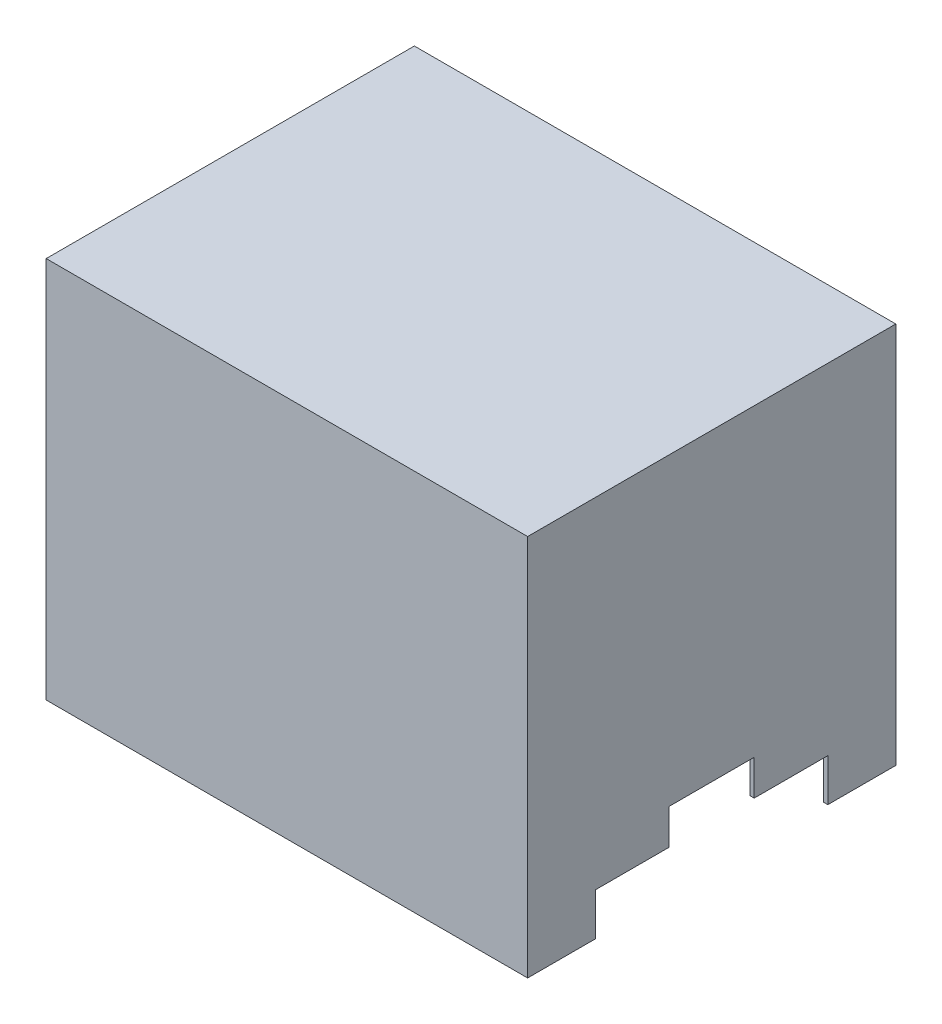
ISO-10303-21;
HEADER;
FILE_DESCRIPTION(('STEP AP214'),'2;1');
FILE_NAME('part.step','',(''),(''),'','','');
FILE_SCHEMA(('AUTOMOTIVE_DESIGN { 1 0 10303 214 1 1 1 1 }'));
ENDSEC;
DATA;
#1=APPLICATION_CONTEXT('core data for automotive mechanical design processes');
#2=APPLICATION_PROTOCOL_DEFINITION('international standard','automotive_design',2000,#1);
#3=PRODUCT_CONTEXT('',#1,'mechanical');
#4=PRODUCT('Part','Part','',(#3));
#5=PRODUCT_RELATED_PRODUCT_CATEGORY('part','',(#4));
#6=PRODUCT_DEFINITION_FORMATION('','',#4);
#7=PRODUCT_DEFINITION_CONTEXT('part definition',#1,'design');
#8=PRODUCT_DEFINITION('design','',#6,#7);
#9=PRODUCT_DEFINITION_SHAPE('','',#8);
#10=(LENGTH_UNIT() NAMED_UNIT(*) SI_UNIT(.MILLI.,.METRE.));
#11=(NAMED_UNIT(*) PLANE_ANGLE_UNIT() SI_UNIT($,.RADIAN.));
#12=(NAMED_UNIT(*) SI_UNIT($,.STERADIAN.) SOLID_ANGLE_UNIT());
#13=UNCERTAINTY_MEASURE_WITH_UNIT(LENGTH_MEASURE(1.E-05),#10,'distance_accuracy_value','');
#14=(GEOMETRIC_REPRESENTATION_CONTEXT(3) GLOBAL_UNCERTAINTY_ASSIGNED_CONTEXT((#13)) GLOBAL_UNIT_ASSIGNED_CONTEXT((#10,
#11,#12)) REPRESENTATION_CONTEXT('',''));
#15=CARTESIAN_POINT('',(0.,0.,0.));
#16=DIRECTION('',(0.,0.,1.));
#17=DIRECTION('',(1.,0.,0.));
#18=AXIS2_PLACEMENT_3D('',#15,#16,#17);
#19=CARTESIAN_POINT('',(0.,0.,0.));
#20=DIRECTION('',(0.,1.,0.));
#21=DIRECTION('',(0.,0.,1.));
#22=AXIS2_PLACEMENT_3D('',#19,#20,#21);
#23=PLANE('',#22);
#24=DIRECTION('',(0.,0.,1.));
#25=VECTOR('',#24,1.);
#26=CARTESIAN_POINT('',(-170.,0.,-130.));
#27=LINE('',#26,#25);
#28=CARTESIAN_POINT('',(-170.,0.,82.));
#29=VERTEX_POINT('',#28);
#30=CARTESIAN_POINT('',(-170.,0.,130.));
#31=VERTEX_POINT('',#30);
#32=EDGE_CURVE('E233',#29,#31,#27,.T.);
#33=ORIENTED_EDGE('',*,*,#32,.F.);
#34=DIRECTION('',(1.,0.,0.));
#35=VECTOR('',#34,1.);
#36=CARTESIAN_POINT('',(-170.,0.,82.));
#37=LINE('',#36,#35);
#38=CARTESIAN_POINT('',(-167.,0.,82.));
#39=VERTEX_POINT('',#38);
#40=EDGE_CURVE('E304',#29,#39,#37,.T.);
#41=ORIENTED_EDGE('',*,*,#40,.T.);
#42=DIRECTION('',(0.,0.,-1.));
#43=VECTOR('',#42,1.);
#44=CARTESIAN_POINT('',(-167.,0.,127.));
#45=LINE('',#44,#43);
#46=CARTESIAN_POINT('',(-167.,0.,127.));
#47=VERTEX_POINT('',#46);
#48=EDGE_CURVE('E383',#47,#39,#45,.T.);
#49=ORIENTED_EDGE('',*,*,#48,.F.);
#50=DIRECTION('',(-1.,0.,0.));
#51=VECTOR('',#50,1.);
#52=CARTESIAN_POINT('',(-167.,0.,127.));
#53=LINE('',#52,#51);
#54=CARTESIAN_POINT('',(167.,0.,127.));
#55=VERTEX_POINT('',#54);
#56=EDGE_CURVE('E379',#55,#47,#53,.T.);
#57=ORIENTED_EDGE('',*,*,#56,.F.);
#58=DIRECTION('',(0.,0.,1.));
#59=VECTOR('',#58,1.);
#60=CARTESIAN_POINT('',(167.,0.,127.));
#61=LINE('',#60,#59);
#62=CARTESIAN_POINT('',(167.,0.,82.));
#63=VERTEX_POINT('',#62);
#64=EDGE_CURVE('E356',#63,#55,#61,.T.);
#65=ORIENTED_EDGE('',*,*,#64,.F.);
#66=CARTESIAN_POINT('',(170.,0.,82.));
#67=VERTEX_POINT('',#66);
#68=EDGE_CURVE('E297',#63,#67,#37,.T.);
#69=ORIENTED_EDGE('',*,*,#68,.T.);
#70=DIRECTION('',(0.,0.,-1.));
#71=VECTOR('',#70,1.);
#72=CARTESIAN_POINT('',(170.,0.,-130.));
#73=LINE('',#72,#71);
#74=CARTESIAN_POINT('',(170.,0.,130.));
#75=VERTEX_POINT('',#74);
#76=EDGE_CURVE('E413',#75,#67,#73,.T.);
#77=ORIENTED_EDGE('',*,*,#76,.F.);
#78=DIRECTION('',(1.,0.,0.));
#79=VECTOR('',#78,1.);
#80=CARTESIAN_POINT('',(-170.,0.,130.));
#81=LINE('',#80,#79);
#82=EDGE_CURVE('E232',#31,#75,#81,.T.);
#83=ORIENTED_EDGE('',*,*,#82,.F.);
#84=EDGE_LOOP('',(#33,#41,#49,#57,#65,#69,#77,#83));
#85=FACE_BOUND('',#84,.T.);
#86=ADVANCED_FACE('F41',(#85),#23,.F.);
#87=CARTESIAN_POINT('',(170.,270.,-130.));
#88=DIRECTION('',(-1.,0.,0.));
#89=DIRECTION('',(0.,0.,1.));
#90=AXIS2_PLACEMENT_3D('',#87,#88,#89);
#91=PLANE('',#90);
#92=ORIENTED_EDGE('',*,*,#76,.T.);
#93=DIRECTION('',(0.,-1.,0.));
#94=VECTOR('',#93,1.);
#95=CARTESIAN_POINT('',(170.,0.,82.));
#96=LINE('',#95,#94);
#97=CARTESIAN_POINT('',(170.,30.,82.));
#98=VERTEX_POINT('',#97);
#99=EDGE_CURVE('E211',#98,#67,#96,.T.);
#100=ORIENTED_EDGE('',*,*,#99,.F.);
#101=DIRECTION('',(0.,0.,1.));
#102=VECTOR('',#101,1.);
#103=CARTESIAN_POINT('',(170.,30.,82.));
#104=LINE('',#103,#102);
#105=CARTESIAN_POINT('',(170.,30.,30.));
#106=VERTEX_POINT('',#105);
#107=EDGE_CURVE('E504',#106,#98,#104,.T.);
#108=ORIENTED_EDGE('',*,*,#107,.F.);
#109=DIRECTION('',(0.,-1.,0.));
#110=VECTOR('',#109,1.);
#111=CARTESIAN_POINT('',(170.,30.,30.));
#112=LINE('',#111,#110);
#113=CARTESIAN_POINT('',(170.,55.,30.));
#114=VERTEX_POINT('',#113);
#115=EDGE_CURVE('E455',#114,#106,#112,.T.);
#116=ORIENTED_EDGE('',*,*,#115,.F.);
#117=DIRECTION('',(0.,0.,1.));
#118=VECTOR('',#117,1.);
#119=CARTESIAN_POINT('',(170.,55.,30.));
#120=LINE('',#119,#118);
#121=CARTESIAN_POINT('',(170.,55.,-30.));
#122=VERTEX_POINT('',#121);
#123=EDGE_CURVE('E510',#122,#114,#120,.T.);
#124=ORIENTED_EDGE('',*,*,#123,.F.);
#125=DIRECTION('',(0.,1.,0.));
#126=VECTOR('',#125,1.);
#127=CARTESIAN_POINT('',(170.,55.,-30.));
#128=LINE('',#127,#126);
#129=CARTESIAN_POINT('',(170.,30.,-30.));
#130=VERTEX_POINT('',#129);
#131=EDGE_CURVE('E515',#130,#122,#128,.T.);
#132=ORIENTED_EDGE('',*,*,#131,.F.);
#133=DIRECTION('',(0.,0.,1.));
#134=VECTOR('',#133,1.);
#135=CARTESIAN_POINT('',(170.,30.,-30.));
#136=LINE('',#135,#134);
#137=CARTESIAN_POINT('',(170.,30.,-82.));
#138=VERTEX_POINT('',#137);
#139=EDGE_CURVE('E520',#138,#130,#136,.T.);
#140=ORIENTED_EDGE('',*,*,#139,.F.);
#141=DIRECTION('',(0.,1.,0.));
#142=VECTOR('',#141,1.);
#143=CARTESIAN_POINT('',(170.,30.,-82.));
#144=LINE('',#143,#142);
#145=CARTESIAN_POINT('',(170.,0.,-82.));
#146=VERTEX_POINT('',#145);
#147=EDGE_CURVE('E427',#146,#138,#144,.T.);
#148=ORIENTED_EDGE('',*,*,#147,.F.);
#149=CARTESIAN_POINT('',(170.,0.,-130.));
#150=VERTEX_POINT('',#149);
#151=EDGE_CURVE('E392',#146,#150,#73,.T.);
#152=ORIENTED_EDGE('',*,*,#151,.T.);
#153=DIRECTION('',(0.,-1.,0.));
#154=VECTOR('',#153,1.);
#155=CARTESIAN_POINT('',(170.,270.,-130.));
#156=LINE('',#155,#154);
#157=CARTESIAN_POINT('',(170.,270.,-130.));
#158=VERTEX_POINT('',#157);
#159=EDGE_CURVE('E255',#158,#150,#156,.T.);
#160=ORIENTED_EDGE('',*,*,#159,.F.);
#161=DIRECTION('',(0.,0.,-1.));
#162=VECTOR('',#161,1.);
#163=CARTESIAN_POINT('',(170.,270.,-130.));
#164=LINE('',#163,#162);
#165=CARTESIAN_POINT('',(170.,270.,130.));
#166=VERTEX_POINT('',#165);
#167=EDGE_CURVE('E238',#166,#158,#164,.T.);
#168=ORIENTED_EDGE('',*,*,#167,.F.);
#169=DIRECTION('',(0.,-1.,0.));
#170=VECTOR('',#169,1.);
#171=CARTESIAN_POINT('',(170.,270.,130.));
#172=LINE('',#171,#170);
#173=EDGE_CURVE('E244',#166,#75,#172,.T.);
#174=ORIENTED_EDGE('',*,*,#173,.T.);
#175=EDGE_LOOP('',(#92,#100,#108,#116,#124,#132,#140,#148,#152,#160,#168,#174));
#176=FACE_BOUND('',#175,.T.);
#177=ADVANCED_FACE('F43',(#176),#91,.F.);
#178=CARTESIAN_POINT('',(-170.,270.,-130.));
#179=DIRECTION('',(0.,0.,1.));
#180=DIRECTION('',(1.,0.,0.));
#181=AXIS2_PLACEMENT_3D('',#178,#179,#180);
#182=PLANE('',#181);
#183=DIRECTION('',(-1.,0.,0.));
#184=VECTOR('',#183,1.);
#185=CARTESIAN_POINT('',(-170.,0.,-130.));
#186=LINE('',#185,#184);
#187=CARTESIAN_POINT('',(-170.,0.,-130.));
#188=VERTEX_POINT('',#187);
#189=EDGE_CURVE('E240',#150,#188,#186,.T.);
#190=ORIENTED_EDGE('',*,*,#189,.T.);
#191=DIRECTION('',(0.,-1.,0.));
#192=VECTOR('',#191,1.);
#193=CARTESIAN_POINT('',(-170.,270.,-130.));
#194=LINE('',#193,#192);
#195=CARTESIAN_POINT('',(-170.,270.,-130.));
#196=VERTEX_POINT('',#195);
#197=EDGE_CURVE('E230',#196,#188,#194,.T.);
#198=ORIENTED_EDGE('',*,*,#197,.F.);
#199=DIRECTION('',(-1.,0.,0.));
#200=VECTOR('',#199,1.);
#201=CARTESIAN_POINT('',(-170.,270.,-130.));
#202=LINE('',#201,#200);
#203=EDGE_CURVE('E406',#158,#196,#202,.T.);
#204=ORIENTED_EDGE('',*,*,#203,.F.);
#205=ORIENTED_EDGE('',*,*,#159,.T.);
#206=EDGE_LOOP('',(#190,#198,#204,#205));
#207=FACE_BOUND('',#206,.T.);
#208=ADVANCED_FACE('F430',(#207),#182,.F.);
#209=CARTESIAN_POINT('',(-170.,270.,-130.));
#210=DIRECTION('',(1.,0.,0.));
#211=DIRECTION('',(0.,0.,-1.));
#212=AXIS2_PLACEMENT_3D('',#209,#210,#211);
#213=PLANE('',#212);
#214=DIRECTION('',(0.,0.,1.));
#215=VECTOR('',#214,1.);
#216=CARTESIAN_POINT('',(-170.,30.,82.));
#217=LINE('',#216,#215);
#218=CARTESIAN_POINT('',(-170.,30.,30.));
#219=VERTEX_POINT('',#218);
#220=CARTESIAN_POINT('',(-170.,30.,82.));
#221=VERTEX_POINT('',#220);
#222=EDGE_CURVE('E478',#219,#221,#217,.T.);
#223=ORIENTED_EDGE('',*,*,#222,.T.);
#224=DIRECTION('',(0.,-1.,0.));
#225=VECTOR('',#224,1.);
#226=CARTESIAN_POINT('',(-170.,0.,82.));
#227=LINE('',#226,#225);
#228=EDGE_CURVE('E295',#221,#29,#227,.T.);
#229=ORIENTED_EDGE('',*,*,#228,.T.);
#230=ORIENTED_EDGE('',*,*,#32,.T.);
#231=DIRECTION('',(0.,-1.,0.));
#232=VECTOR('',#231,1.);
#233=CARTESIAN_POINT('',(-170.,270.,130.));
#234=LINE('',#233,#232);
#235=CARTESIAN_POINT('',(-170.,270.,130.));
#236=VERTEX_POINT('',#235);
#237=EDGE_CURVE('E248',#236,#31,#234,.T.);
#238=ORIENTED_EDGE('',*,*,#237,.F.);
#239=DIRECTION('',(0.,0.,1.));
#240=VECTOR('',#239,1.);
#241=CARTESIAN_POINT('',(-170.,270.,-130.));
#242=LINE('',#241,#240);
#243=EDGE_CURVE('E409',#196,#236,#242,.T.);
#244=ORIENTED_EDGE('',*,*,#243,.F.);
#245=ORIENTED_EDGE('',*,*,#197,.T.);
#246=CARTESIAN_POINT('',(-170.,0.,-82.));
#247=VERTEX_POINT('',#246);
#248=EDGE_CURVE('E219',#188,#247,#27,.T.);
#249=ORIENTED_EDGE('',*,*,#248,.T.);
#250=DIRECTION('',(0.,1.,0.));
#251=VECTOR('',#250,1.);
#252=CARTESIAN_POINT('',(-170.,30.,-82.));
#253=LINE('',#252,#251);
#254=CARTESIAN_POINT('',(-170.,30.,-82.));
#255=VERTEX_POINT('',#254);
#256=EDGE_CURVE('E201',#247,#255,#253,.T.);
#257=ORIENTED_EDGE('',*,*,#256,.T.);
#258=DIRECTION('',(0.,0.,1.));
#259=VECTOR('',#258,1.);
#260=CARTESIAN_POINT('',(-170.,30.,-30.));
#261=LINE('',#260,#259);
#262=CARTESIAN_POINT('',(-170.,30.,-30.));
#263=VERTEX_POINT('',#262);
#264=EDGE_CURVE('E210',#255,#263,#261,.T.);
#265=ORIENTED_EDGE('',*,*,#264,.T.);
#266=DIRECTION('',(0.,1.,0.));
#267=VECTOR('',#266,1.);
#268=CARTESIAN_POINT('',(-170.,55.,-30.));
#269=LINE('',#268,#267);
#270=CARTESIAN_POINT('',(-170.,55.,-30.));
#271=VERTEX_POINT('',#270);
#272=EDGE_CURVE('E492',#263,#271,#269,.T.);
#273=ORIENTED_EDGE('',*,*,#272,.T.);
#274=DIRECTION('',(0.,0.,1.));
#275=VECTOR('',#274,1.);
#276=CARTESIAN_POINT('',(-170.,55.,30.));
#277=LINE('',#276,#275);
#278=CARTESIAN_POINT('',(-170.,55.,30.));
#279=VERTEX_POINT('',#278);
#280=EDGE_CURVE('E487',#271,#279,#277,.T.);
#281=ORIENTED_EDGE('',*,*,#280,.T.);
#282=DIRECTION('',(0.,-1.,0.));
#283=VECTOR('',#282,1.);
#284=CARTESIAN_POINT('',(-170.,30.,30.));
#285=LINE('',#284,#283);
#286=EDGE_CURVE('E482',#279,#219,#285,.T.);
#287=ORIENTED_EDGE('',*,*,#286,.T.);
#288=EDGE_LOOP('',(#223,#229,#230,#238,#244,#245,#249,#257,#265,#273,#281,#287));
#289=FACE_BOUND('',#288,.T.);
#290=ADVANCED_FACE('F227',(#289),#213,.F.);
#291=CARTESIAN_POINT('',(-170.,270.,130.));
#292=DIRECTION('',(0.,0.,-1.));
#293=DIRECTION('',(-1.,0.,0.));
#294=AXIS2_PLACEMENT_3D('',#291,#292,#293);
#295=PLANE('',#294);
#296=ORIENTED_EDGE('',*,*,#82,.T.);
#297=ORIENTED_EDGE('',*,*,#173,.F.);
#298=DIRECTION('',(1.,0.,0.));
#299=VECTOR('',#298,1.);
#300=CARTESIAN_POINT('',(-170.,270.,130.));
#301=LINE('',#300,#299);
#302=EDGE_CURVE('E249',#236,#166,#301,.T.);
#303=ORIENTED_EDGE('',*,*,#302,.F.);
#304=ORIENTED_EDGE('',*,*,#237,.T.);
#305=EDGE_LOOP('',(#296,#297,#303,#304));
#306=FACE_BOUND('',#305,.T.);
#307=ADVANCED_FACE('F609',(#306),#295,.F.);
#308=CARTESIAN_POINT('',(0.,270.,0.));
#309=DIRECTION('',(0.,1.,0.));
#310=DIRECTION('',(0.,0.,1.));
#311=AXIS2_PLACEMENT_3D('',#308,#309,#310);
#312=PLANE('',#311);
#313=ORIENTED_EDGE('',*,*,#167,.T.);
#314=ORIENTED_EDGE('',*,*,#203,.T.);
#315=ORIENTED_EDGE('',*,*,#243,.T.);
#316=ORIENTED_EDGE('',*,*,#302,.T.);
#317=EDGE_LOOP('',(#313,#314,#315,#316));
#318=FACE_BOUND('',#317,.T.);
#319=ADVANCED_FACE('F432',(#318),#312,.T.);
#320=ORIENTED_EDGE('',*,*,#151,.F.);
#321=DIRECTION('',(1.,0.,0.));
#322=VECTOR('',#321,1.);
#323=CARTESIAN_POINT('',(-170.,0.,-82.));
#324=LINE('',#323,#322);
#325=CARTESIAN_POINT('',(167.,0.,-82.));
#326=VERTEX_POINT('',#325);
#327=EDGE_CURVE('E223',#326,#146,#324,.T.);
#328=ORIENTED_EDGE('',*,*,#327,.F.);
#329=CARTESIAN_POINT('',(167.,0.,-127.));
#330=VERTEX_POINT('',#329);
#331=EDGE_CURVE('E375',#330,#326,#61,.T.);
#332=ORIENTED_EDGE('',*,*,#331,.F.);
#333=DIRECTION('',(1.,0.,0.));
#334=VECTOR('',#333,1.);
#335=CARTESIAN_POINT('',(-167.,0.,-127.));
#336=LINE('',#335,#334);
#337=CARTESIAN_POINT('',(-167.,0.,-127.));
#338=VERTEX_POINT('',#337);
#339=EDGE_CURVE('E362',#338,#330,#336,.T.);
#340=ORIENTED_EDGE('',*,*,#339,.F.);
#341=CARTESIAN_POINT('',(-167.,0.,-81.9999999999999));
#342=VERTEX_POINT('',#341);
#343=EDGE_CURVE('E221',#342,#338,#45,.T.);
#344=ORIENTED_EDGE('',*,*,#343,.F.);
#345=EDGE_CURVE('E65',#247,#342,#324,.T.);
#346=ORIENTED_EDGE('',*,*,#345,.F.);
#347=ORIENTED_EDGE('',*,*,#248,.F.);
#348=ORIENTED_EDGE('',*,*,#189,.F.);
#349=EDGE_LOOP('',(#320,#328,#332,#340,#344,#346,#347,#348));
#350=FACE_BOUND('',#349,.T.);
#351=ADVANCED_FACE('F217',(#350),#23,.F.);
#352=CARTESIAN_POINT('',(167.,267.,127.));
#353=DIRECTION('',(1.,0.,0.));
#354=DIRECTION('',(0.,0.,-1.));
#355=AXIS2_PLACEMENT_3D('',#352,#353,#354);
#356=PLANE('',#355);
#357=DIRECTION('',(0.,0.,1.));
#358=VECTOR('',#357,1.);
#359=CARTESIAN_POINT('',(167.,30.,127.));
#360=LINE('',#359,#358);
#361=CARTESIAN_POINT('',(167.,30.,30.));
#362=VERTEX_POINT('',#361);
#363=CARTESIAN_POINT('',(167.,30.,82.));
#364=VERTEX_POINT('',#363);
#365=EDGE_CURVE('E348',#362,#364,#360,.T.);
#366=ORIENTED_EDGE('',*,*,#365,.T.);
#367=DIRECTION('',(0.,-1.,0.));
#368=VECTOR('',#367,1.);
#369=CARTESIAN_POINT('',(167.,267.,82.));
#370=LINE('',#369,#368);
#371=EDGE_CURVE('E352',#364,#63,#370,.T.);
#372=ORIENTED_EDGE('',*,*,#371,.T.);
#373=ORIENTED_EDGE('',*,*,#64,.T.);
#374=DIRECTION('',(0.,-1.,0.));
#375=VECTOR('',#374,1.);
#376=CARTESIAN_POINT('',(167.,267.,127.));
#377=LINE('',#376,#375);
#378=CARTESIAN_POINT('',(167.,267.,127.));
#379=VERTEX_POINT('',#378);
#380=EDGE_CURVE('E374',#379,#55,#377,.T.);
#381=ORIENTED_EDGE('',*,*,#380,.F.);
#382=DIRECTION('',(0.,0.,1.));
#383=VECTOR('',#382,1.);
#384=CARTESIAN_POINT('',(167.,267.,127.));
#385=LINE('',#384,#383);
#386=CARTESIAN_POINT('',(167.,267.,-127.));
#387=VERTEX_POINT('',#386);
#388=EDGE_CURVE('E357',#387,#379,#385,.T.);
#389=ORIENTED_EDGE('',*,*,#388,.F.);
#390=DIRECTION('',(0.,-1.,0.));
#391=VECTOR('',#390,1.);
#392=CARTESIAN_POINT('',(167.,267.,-127.));
#393=LINE('',#392,#391);
#394=EDGE_CURVE('E389',#387,#330,#393,.T.);
#395=ORIENTED_EDGE('',*,*,#394,.T.);
#396=ORIENTED_EDGE('',*,*,#331,.T.);
#397=DIRECTION('',(0.,1.,0.));
#398=VECTOR('',#397,1.);
#399=CARTESIAN_POINT('',(167.,267.,-82.));
#400=LINE('',#399,#398);
#401=CARTESIAN_POINT('',(167.,30.,-82.));
#402=VERTEX_POINT('',#401);
#403=EDGE_CURVE('E328',#326,#402,#400,.T.);
#404=ORIENTED_EDGE('',*,*,#403,.T.);
#405=DIRECTION('',(0.,0.,1.));
#406=VECTOR('',#405,1.);
#407=CARTESIAN_POINT('',(167.,30.,127.));
#408=LINE('',#407,#406);
#409=CARTESIAN_POINT('',(167.,30.,-30.));
#410=VERTEX_POINT('',#409);
#411=EDGE_CURVE('E332',#402,#410,#408,.T.);
#412=ORIENTED_EDGE('',*,*,#411,.T.);
#413=DIRECTION('',(0.,1.,0.));
#414=VECTOR('',#413,1.);
#415=CARTESIAN_POINT('',(167.,267.,-30.));
#416=LINE('',#415,#414);
#417=CARTESIAN_POINT('',(167.,55.,-30.));
#418=VERTEX_POINT('',#417);
#419=EDGE_CURVE('E336',#410,#418,#416,.T.);
#420=ORIENTED_EDGE('',*,*,#419,.T.);
#421=DIRECTION('',(0.,0.,1.));
#422=VECTOR('',#421,1.);
#423=CARTESIAN_POINT('',(167.,55.,127.));
#424=LINE('',#423,#422);
#425=CARTESIAN_POINT('',(167.,55.,30.));
#426=VERTEX_POINT('',#425);
#427=EDGE_CURVE('E340',#418,#426,#424,.T.);
#428=ORIENTED_EDGE('',*,*,#427,.T.);
#429=DIRECTION('',(0.,-1.,0.));
#430=VECTOR('',#429,1.);
#431=CARTESIAN_POINT('',(167.,267.,30.));
#432=LINE('',#431,#430);
#433=EDGE_CURVE('E344',#426,#362,#432,.T.);
#434=ORIENTED_EDGE('',*,*,#433,.T.);
#435=EDGE_LOOP('',(#366,#372,#373,#381,#389,#395,#396,#404,#412,#420,#428,#434));
#436=FACE_BOUND('',#435,.T.);
#437=ADVANCED_FACE('F445',(#436),#356,.F.);
#438=CARTESIAN_POINT('',(-167.,267.,-127.));
#439=DIRECTION('',(0.,0.,-1.));
#440=DIRECTION('',(-1.,0.,0.));
#441=AXIS2_PLACEMENT_3D('',#438,#439,#440);
#442=PLANE('',#441);
#443=ORIENTED_EDGE('',*,*,#339,.T.);
#444=ORIENTED_EDGE('',*,*,#394,.F.);
#445=DIRECTION('',(1.,0.,0.));
#446=VECTOR('',#445,1.);
#447=CARTESIAN_POINT('',(-167.,267.,-127.));
#448=LINE('',#447,#446);
#449=CARTESIAN_POINT('',(-167.,267.,-127.));
#450=VERTEX_POINT('',#449);
#451=EDGE_CURVE('E370',#450,#387,#448,.T.);
#452=ORIENTED_EDGE('',*,*,#451,.F.);
#453=DIRECTION('',(0.,-1.,0.));
#454=VECTOR('',#453,1.);
#455=CARTESIAN_POINT('',(-167.,267.,-127.));
#456=LINE('',#455,#454);
#457=EDGE_CURVE('E393',#450,#338,#456,.T.);
#458=ORIENTED_EDGE('',*,*,#457,.T.);
#459=EDGE_LOOP('',(#443,#444,#452,#458));
#460=FACE_BOUND('',#459,.T.);
#461=ADVANCED_FACE('F536',(#460),#442,.F.);
#462=CARTESIAN_POINT('',(-167.,267.,127.));
#463=DIRECTION('',(-1.,0.,0.));
#464=DIRECTION('',(0.,0.,1.));
#465=AXIS2_PLACEMENT_3D('',#462,#463,#464);
#466=PLANE('',#465);
#467=ORIENTED_EDGE('',*,*,#48,.T.);
#468=DIRECTION('',(0.,1.,0.));
#469=VECTOR('',#468,1.);
#470=CARTESIAN_POINT('',(-167.,267.,82.));
#471=LINE('',#470,#469);
#472=CARTESIAN_POINT('',(-167.,30.,82.));
#473=VERTEX_POINT('',#472);
#474=EDGE_CURVE('E11',#39,#473,#471,.T.);
#475=ORIENTED_EDGE('',*,*,#474,.T.);
#476=DIRECTION('',(0.,0.,-1.));
#477=VECTOR('',#476,1.);
#478=CARTESIAN_POINT('',(-167.,30.,127.));
#479=LINE('',#478,#477);
#480=CARTESIAN_POINT('',(-167.,30.,30.));
#481=VERTEX_POINT('',#480);
#482=EDGE_CURVE('E50',#473,#481,#479,.T.);
#483=ORIENTED_EDGE('',*,*,#482,.T.);
#484=DIRECTION('',(0.,1.,0.));
#485=VECTOR('',#484,1.);
#486=CARTESIAN_POINT('',(-167.,267.,30.));
#487=LINE('',#486,#485);
#488=CARTESIAN_POINT('',(-167.,55.,30.));
#489=VERTEX_POINT('',#488);
#490=EDGE_CURVE('E274',#481,#489,#487,.T.);
#491=ORIENTED_EDGE('',*,*,#490,.T.);
#492=DIRECTION('',(0.,0.,-1.));
#493=VECTOR('',#492,1.);
#494=CARTESIAN_POINT('',(-167.,55.,127.));
#495=LINE('',#494,#493);
#496=CARTESIAN_POINT('',(-167.,55.,-30.));
#497=VERTEX_POINT('',#496);
#498=EDGE_CURVE('E270',#489,#497,#495,.T.);
#499=ORIENTED_EDGE('',*,*,#498,.T.);
#500=DIRECTION('',(0.,-1.,0.));
#501=VECTOR('',#500,1.);
#502=CARTESIAN_POINT('',(-167.,267.,-30.));
#503=LINE('',#502,#501);
#504=CARTESIAN_POINT('',(-167.,30.,-30.));
#505=VERTEX_POINT('',#504);
#506=EDGE_CURVE('E266',#497,#505,#503,.T.);
#507=ORIENTED_EDGE('',*,*,#506,.T.);
#508=DIRECTION('',(0.,0.,-1.));
#509=VECTOR('',#508,1.);
#510=CARTESIAN_POINT('',(-167.,30.,127.));
#511=LINE('',#510,#509);
#512=CARTESIAN_POINT('',(-167.,30.,-82.));
#513=VERTEX_POINT('',#512);
#514=EDGE_CURVE('E262',#505,#513,#511,.T.);
#515=ORIENTED_EDGE('',*,*,#514,.T.);
#516=DIRECTION('',(0.,-1.,0.));
#517=VECTOR('',#516,1.);
#518=CARTESIAN_POINT('',(-167.,267.,-82.));
#519=LINE('',#518,#517);
#520=EDGE_CURVE('E259',#513,#342,#519,.T.);
#521=ORIENTED_EDGE('',*,*,#520,.T.);
#522=ORIENTED_EDGE('',*,*,#343,.T.);
#523=ORIENTED_EDGE('',*,*,#457,.F.);
#524=DIRECTION('',(0.,0.,-1.));
#525=VECTOR('',#524,1.);
#526=CARTESIAN_POINT('',(-167.,267.,127.));
#527=LINE('',#526,#525);
#528=CARTESIAN_POINT('',(-167.,267.,127.));
#529=VERTEX_POINT('',#528);
#530=EDGE_CURVE('E366',#529,#450,#527,.T.);
#531=ORIENTED_EDGE('',*,*,#530,.F.);
#532=DIRECTION('',(0.,-1.,0.));
#533=VECTOR('',#532,1.);
#534=CARTESIAN_POINT('',(-167.,267.,127.));
#535=LINE('',#534,#533);
#536=EDGE_CURVE('E397',#529,#47,#535,.T.);
#537=ORIENTED_EDGE('',*,*,#536,.T.);
#538=EDGE_LOOP('',(#467,#475,#483,#491,#499,#507,#515,#521,#522,#523,#531,#537));
#539=FACE_BOUND('',#538,.T.);
#540=ADVANCED_FACE('F282',(#539),#466,.F.);
#541=CARTESIAN_POINT('',(-167.,267.,127.));
#542=DIRECTION('',(0.,0.,1.));
#543=DIRECTION('',(1.,0.,0.));
#544=AXIS2_PLACEMENT_3D('',#541,#542,#543);
#545=PLANE('',#544);
#546=ORIENTED_EDGE('',*,*,#56,.T.);
#547=ORIENTED_EDGE('',*,*,#536,.F.);
#548=DIRECTION('',(-1.,0.,0.));
#549=VECTOR('',#548,1.);
#550=CARTESIAN_POINT('',(-167.,267.,127.));
#551=LINE('',#550,#549);
#552=EDGE_CURVE('E361',#379,#529,#551,.T.);
#553=ORIENTED_EDGE('',*,*,#552,.F.);
#554=ORIENTED_EDGE('',*,*,#380,.T.);
#555=EDGE_LOOP('',(#546,#547,#553,#554));
#556=FACE_BOUND('',#555,.T.);
#557=ADVANCED_FACE('F544',(#556),#545,.F.);
#558=CARTESIAN_POINT('',(0.,267.,0.));
#559=DIRECTION('',(0.,-1.,0.));
#560=DIRECTION('',(0.,0.,-1.));
#561=AXIS2_PLACEMENT_3D('',#558,#559,#560);
#562=PLANE('',#561);
#563=ORIENTED_EDGE('',*,*,#388,.T.);
#564=ORIENTED_EDGE('',*,*,#552,.T.);
#565=ORIENTED_EDGE('',*,*,#530,.T.);
#566=ORIENTED_EDGE('',*,*,#451,.T.);
#567=EDGE_LOOP('',(#563,#564,#565,#566));
#568=FACE_BOUND('',#567,.T.);
#569=ADVANCED_FACE('F541',(#568),#562,.T.);
#570=CARTESIAN_POINT('',(-170.,30.,-82.));
#571=DIRECTION('',(0.,0.,-1.));
#572=DIRECTION('',(-1.,0.,0.));
#573=AXIS2_PLACEMENT_3D('',#570,#571,#572);
#574=PLANE('',#573);
#575=DIRECTION('',(1.,0.,0.));
#576=VECTOR('',#575,1.);
#577=CARTESIAN_POINT('',(-170.,30.,-82.));
#578=LINE('',#577,#576);
#579=EDGE_CURVE('E204',#255,#513,#578,.T.);
#580=ORIENTED_EDGE('',*,*,#579,.F.);
#581=ORIENTED_EDGE('',*,*,#256,.F.);
#582=ORIENTED_EDGE('',*,*,#345,.T.);
#583=ORIENTED_EDGE('',*,*,#520,.F.);
#584=EDGE_LOOP('',(#580,#581,#582,#583));
#585=FACE_BOUND('',#584,.T.);
#586=ADVANCED_FACE('F202',(#585),#574,.F.);
#587=CARTESIAN_POINT('',(-170.,30.,-30.));
#588=DIRECTION('',(0.,1.,0.));
#589=DIRECTION('',(0.,0.,1.));
#590=AXIS2_PLACEMENT_3D('',#587,#588,#589);
#591=PLANE('',#590);
#592=DIRECTION('',(1.,0.,0.));
#593=VECTOR('',#592,1.);
#594=CARTESIAN_POINT('',(-170.,30.,-30.));
#595=LINE('',#594,#593);
#596=EDGE_CURVE('E321',#263,#505,#595,.T.);
#597=ORIENTED_EDGE('',*,*,#596,.F.);
#598=ORIENTED_EDGE('',*,*,#264,.F.);
#599=ORIENTED_EDGE('',*,*,#579,.T.);
#600=ORIENTED_EDGE('',*,*,#514,.F.);
#601=EDGE_LOOP('',(#597,#598,#599,#600));
#602=FACE_BOUND('',#601,.T.);
#603=ADVANCED_FACE('F583',(#602),#591,.F.);
#604=CARTESIAN_POINT('',(-170.,55.,-30.));
#605=DIRECTION('',(0.,0.,-1.));
#606=DIRECTION('',(0.,1.,0.));
#607=AXIS2_PLACEMENT_3D('',#604,#605,#606);
#608=PLANE('',#607);
#609=DIRECTION('',(1.,0.,0.));
#610=VECTOR('',#609,1.);
#611=CARTESIAN_POINT('',(-170.,55.,-30.));
#612=LINE('',#611,#610);
#613=EDGE_CURVE('E316',#271,#497,#612,.T.);
#614=ORIENTED_EDGE('',*,*,#613,.F.);
#615=ORIENTED_EDGE('',*,*,#272,.F.);
#616=ORIENTED_EDGE('',*,*,#596,.T.);
#617=ORIENTED_EDGE('',*,*,#506,.F.);
#618=EDGE_LOOP('',(#614,#615,#616,#617));
#619=FACE_BOUND('',#618,.T.);
#620=ADVANCED_FACE('F580',(#619),#608,.F.);
#621=CARTESIAN_POINT('',(-170.,55.,30.));
#622=DIRECTION('',(0.,1.,0.));
#623=DIRECTION('',(0.,0.,1.));
#624=AXIS2_PLACEMENT_3D('',#621,#622,#623);
#625=PLANE('',#624);
#626=DIRECTION('',(1.,0.,0.));
#627=VECTOR('',#626,1.);
#628=CARTESIAN_POINT('',(-170.,55.,30.));
#629=LINE('',#628,#627);
#630=EDGE_CURVE('E311',#279,#489,#629,.T.);
#631=ORIENTED_EDGE('',*,*,#630,.F.);
#632=ORIENTED_EDGE('',*,*,#280,.F.);
#633=ORIENTED_EDGE('',*,*,#613,.T.);
#634=ORIENTED_EDGE('',*,*,#498,.F.);
#635=EDGE_LOOP('',(#631,#632,#633,#634));
#636=FACE_BOUND('',#635,.T.);
#637=ADVANCED_FACE('F578',(#636),#625,.F.);
#638=CARTESIAN_POINT('',(-170.,30.,30.));
#639=DIRECTION('',(0.,0.,1.));
#640=DIRECTION('',(1.,0.,0.));
#641=AXIS2_PLACEMENT_3D('',#638,#639,#640);
#642=PLANE('',#641);
#643=DIRECTION('',(1.,0.,0.));
#644=VECTOR('',#643,1.);
#645=CARTESIAN_POINT('',(-170.,30.,30.));
#646=LINE('',#645,#644);
#647=EDGE_CURVE('E290',#219,#481,#646,.T.);
#648=ORIENTED_EDGE('',*,*,#647,.F.);
#649=ORIENTED_EDGE('',*,*,#286,.F.);
#650=ORIENTED_EDGE('',*,*,#630,.T.);
#651=ORIENTED_EDGE('',*,*,#490,.F.);
#652=EDGE_LOOP('',(#648,#649,#650,#651));
#653=FACE_BOUND('',#652,.T.);
#654=ADVANCED_FACE('F576',(#653),#642,.F.);
#655=CARTESIAN_POINT('',(-170.,30.,82.));
#656=DIRECTION('',(0.,1.,0.));
#657=DIRECTION('',(0.,0.,1.));
#658=AXIS2_PLACEMENT_3D('',#655,#656,#657);
#659=PLANE('',#658);
#660=DIRECTION('',(1.,0.,0.));
#661=VECTOR('',#660,1.);
#662=CARTESIAN_POINT('',(-170.,30.,82.));
#663=LINE('',#662,#661);
#664=EDGE_CURVE('E288',#221,#473,#663,.T.);
#665=ORIENTED_EDGE('',*,*,#664,.F.);
#666=ORIENTED_EDGE('',*,*,#222,.F.);
#667=ORIENTED_EDGE('',*,*,#647,.T.);
#668=ORIENTED_EDGE('',*,*,#482,.F.);
#669=EDGE_LOOP('',(#665,#666,#667,#668));
#670=FACE_BOUND('',#669,.T.);
#671=ADVANCED_FACE('F286',(#670),#659,.F.);
#672=CARTESIAN_POINT('',(-170.,0.,82.));
#673=DIRECTION('',(0.,0.,1.));
#674=DIRECTION('',(1.,0.,0.));
#675=AXIS2_PLACEMENT_3D('',#672,#673,#674);
#676=PLANE('',#675);
#677=ORIENTED_EDGE('',*,*,#40,.F.);
#678=ORIENTED_EDGE('',*,*,#228,.F.);
#679=ORIENTED_EDGE('',*,*,#664,.T.);
#680=ORIENTED_EDGE('',*,*,#474,.F.);
#681=EDGE_LOOP('',(#677,#678,#679,#680));
#682=FACE_BOUND('',#681,.T.);
#683=ADVANCED_FACE('F292',(#682),#676,.F.);
#684=EDGE_CURVE('E298',#364,#98,#663,.T.);
#685=ORIENTED_EDGE('',*,*,#684,.T.);
#686=ORIENTED_EDGE('',*,*,#99,.T.);
#687=ORIENTED_EDGE('',*,*,#68,.F.);
#688=ORIENTED_EDGE('',*,*,#371,.F.);
#689=EDGE_LOOP('',(#685,#686,#687,#688));
#690=FACE_BOUND('',#689,.T.);
#691=ADVANCED_FACE('F442',(#690),#676,.F.);
#692=EDGE_CURVE('E310',#362,#106,#646,.T.);
#693=ORIENTED_EDGE('',*,*,#692,.T.);
#694=ORIENTED_EDGE('',*,*,#107,.T.);
#695=ORIENTED_EDGE('',*,*,#684,.F.);
#696=ORIENTED_EDGE('',*,*,#365,.F.);
#697=EDGE_LOOP('',(#693,#694,#695,#696));
#698=FACE_BOUND('',#697,.T.);
#699=ADVANCED_FACE('F448',(#698),#659,.F.);
#700=EDGE_CURVE('E315',#426,#114,#629,.T.);
#701=ORIENTED_EDGE('',*,*,#700,.T.);
#702=ORIENTED_EDGE('',*,*,#115,.T.);
#703=ORIENTED_EDGE('',*,*,#692,.F.);
#704=ORIENTED_EDGE('',*,*,#433,.F.);
#705=EDGE_LOOP('',(#701,#702,#703,#704));
#706=FACE_BOUND('',#705,.T.);
#707=ADVANCED_FACE('F452',(#706),#642,.F.);
#708=EDGE_CURVE('E320',#418,#122,#612,.T.);
#709=ORIENTED_EDGE('',*,*,#708,.T.);
#710=ORIENTED_EDGE('',*,*,#123,.T.);
#711=ORIENTED_EDGE('',*,*,#700,.F.);
#712=ORIENTED_EDGE('',*,*,#427,.F.);
#713=EDGE_LOOP('',(#709,#710,#711,#712));
#714=FACE_BOUND('',#713,.T.);
#715=ADVANCED_FACE('F635',(#714),#625,.F.);
#716=EDGE_CURVE('E325',#410,#130,#595,.T.);
#717=ORIENTED_EDGE('',*,*,#716,.T.);
#718=ORIENTED_EDGE('',*,*,#131,.T.);
#719=ORIENTED_EDGE('',*,*,#708,.F.);
#720=ORIENTED_EDGE('',*,*,#419,.F.);
#721=EDGE_LOOP('',(#717,#718,#719,#720));
#722=FACE_BOUND('',#721,.T.);
#723=ADVANCED_FACE('F591',(#722),#608,.F.);
#724=EDGE_CURVE('E57',#402,#138,#578,.T.);
#725=ORIENTED_EDGE('',*,*,#724,.T.);
#726=ORIENTED_EDGE('',*,*,#139,.T.);
#727=ORIENTED_EDGE('',*,*,#716,.F.);
#728=ORIENTED_EDGE('',*,*,#411,.F.);
#729=EDGE_LOOP('',(#725,#726,#727,#728));
#730=FACE_BOUND('',#729,.T.);
#731=ADVANCED_FACE('F533',(#730),#591,.F.);
#732=ORIENTED_EDGE('',*,*,#327,.T.);
#733=ORIENTED_EDGE('',*,*,#147,.T.);
#734=ORIENTED_EDGE('',*,*,#724,.F.);
#735=ORIENTED_EDGE('',*,*,#403,.F.);
#736=EDGE_LOOP('',(#732,#733,#734,#735));
#737=FACE_BOUND('',#736,.T.);
#738=ADVANCED_FACE('F528',(#737),#574,.F.);
#739=CLOSED_SHELL('',(#86,#177,#208,#290,#307,#319,#351,#437,#461,#540,#557,#569,#586,#603,#620,
#637,#654,#671,#683,#691,#699,#707,#715,#723,#731,#738));
#740=MANIFOLD_SOLID_BREP('B2',#739);
#741=ADVANCED_BREP_SHAPE_REPRESENTATION('',(#18,#740),#14);
#742=SHAPE_DEFINITION_REPRESENTATION(#9,#741);
ENDSEC;
END-ISO-10303-21;
